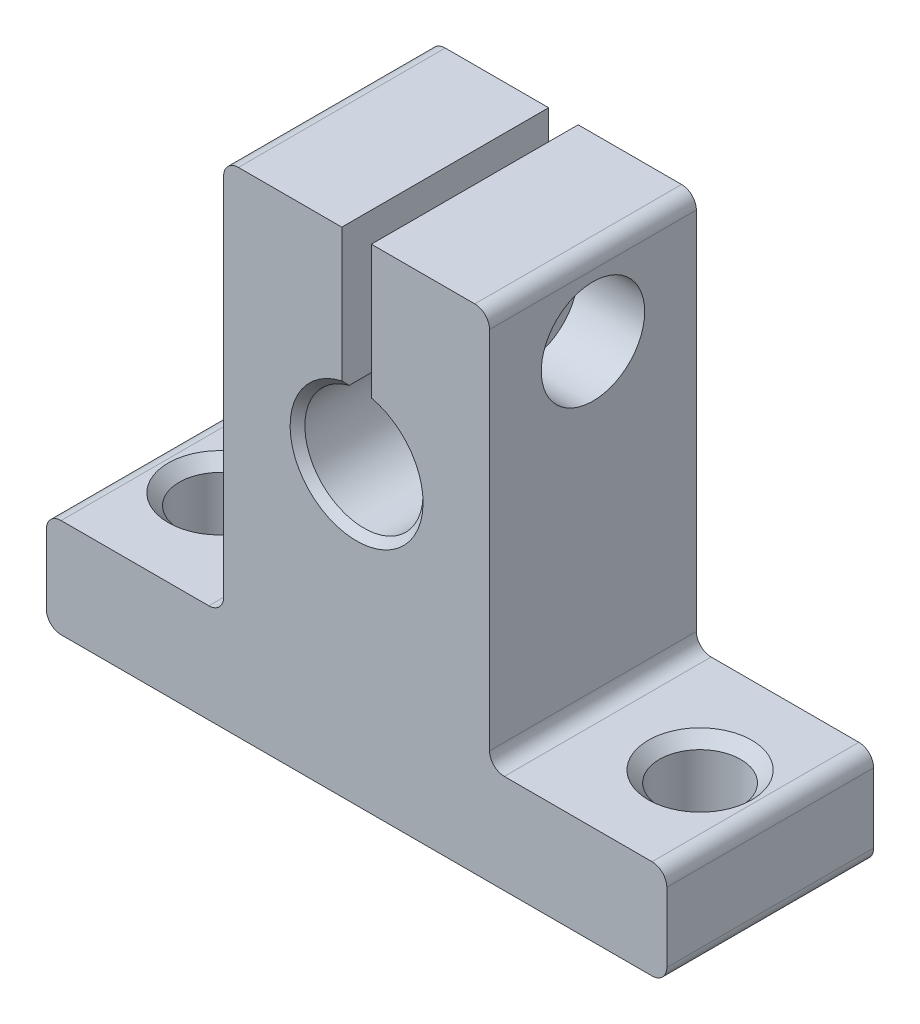
ISO-10303-21;
HEADER;
FILE_DESCRIPTION(('STEP AP214'),'2;1');
FILE_NAME('part.step','',(''),(''),'','','');
FILE_SCHEMA(('AUTOMOTIVE_DESIGN { 1 0 10303 214 1 1 1 1 }'));
ENDSEC;
DATA;
#1=APPLICATION_CONTEXT('core data for automotive mechanical design processes');
#2=APPLICATION_PROTOCOL_DEFINITION('international standard','automotive_design',2000,#1);
#3=PRODUCT_CONTEXT('',#1,'mechanical');
#4=PRODUCT('Part','Part','',(#3));
#5=PRODUCT_RELATED_PRODUCT_CATEGORY('part','',(#4));
#6=PRODUCT_DEFINITION_FORMATION('','',#4);
#7=PRODUCT_DEFINITION_CONTEXT('part definition',#1,'design');
#8=PRODUCT_DEFINITION('design','',#6,#7);
#9=PRODUCT_DEFINITION_SHAPE('','',#8);
#10=(LENGTH_UNIT() NAMED_UNIT(*) SI_UNIT(.MILLI.,.METRE.));
#11=(NAMED_UNIT(*) PLANE_ANGLE_UNIT() SI_UNIT($,.RADIAN.));
#12=(NAMED_UNIT(*) SI_UNIT($,.STERADIAN.) SOLID_ANGLE_UNIT());
#13=UNCERTAINTY_MEASURE_WITH_UNIT(LENGTH_MEASURE(1.E-05),#10,'distance_accuracy_value','');
#14=(GEOMETRIC_REPRESENTATION_CONTEXT(3) GLOBAL_UNCERTAINTY_ASSIGNED_CONTEXT((#13)) GLOBAL_UNIT_ASSIGNED_CONTEXT((#10,
#11,#12)) REPRESENTATION_CONTEXT('',''));
#15=CARTESIAN_POINT('',(0.,0.,0.));
#16=DIRECTION('',(0.,0.,1.));
#17=DIRECTION('',(1.,0.,0.));
#18=AXIS2_PLACEMENT_3D('',#15,#16,#17);
#19=CARTESIAN_POINT('',(-9.00000000000001,-13.3,14.));
#20=DIRECTION('',(0.,-1.,0.));
#21=DIRECTION('',(1.,0.,0.));
#22=AXIS2_PLACEMENT_3D('',#19,#20,#21);
#23=PLANE('',#22);
#24=DIRECTION('',(-1.,0.,0.));
#25=VECTOR('',#24,1.);
#26=CARTESIAN_POINT('',(-9.00000000000001,-13.3,14.));
#27=LINE('',#26,#25);
#28=CARTESIAN_POINT('',(-10.,-13.3,14.));
#29=VERTEX_POINT('',#28);
#30=CARTESIAN_POINT('',(-20.,-13.3,14.));
#31=VERTEX_POINT('',#30);
#32=EDGE_CURVE('E238',#29,#31,#27,.T.);
#33=ORIENTED_EDGE('',*,*,#32,.F.);
#34=DIRECTION('',(0.,0.,-1.));
#35=VECTOR('',#34,1.);
#36=CARTESIAN_POINT('',(-10.,-13.3,0.));
#37=LINE('',#36,#35);
#38=CARTESIAN_POINT('',(-10.,-13.3,0.));
#39=VERTEX_POINT('',#38);
#40=EDGE_CURVE('E319',#29,#39,#37,.T.);
#41=ORIENTED_EDGE('',*,*,#40,.T.);
#42=DIRECTION('',(-1.,0.,0.));
#43=VECTOR('',#42,1.);
#44=CARTESIAN_POINT('',(-9.00000000000001,-13.3,0.));
#45=LINE('',#44,#43);
#46=CARTESIAN_POINT('',(-20.,-13.3,0.));
#47=VERTEX_POINT('',#46);
#48=EDGE_CURVE('E269',#39,#47,#45,.T.);
#49=ORIENTED_EDGE('',*,*,#48,.T.);
#50=DIRECTION('',(0.,0.,-1.));
#51=VECTOR('',#50,1.);
#52=CARTESIAN_POINT('',(-20.,-13.3,14.));
#53=LINE('',#52,#51);
#54=EDGE_CURVE('E317',#47,#31,#53,.F.);
#55=ORIENTED_EDGE('',*,*,#54,.T.);
#56=EDGE_LOOP('',(#33,#41,#49,#55));
#57=FACE_BOUND('',#56,.T.);
#58=CARTESIAN_POINT('',(-16.25,-13.3,7.));
#59=DIRECTION('',(0.,1.,0.));
#60=DIRECTION('',(0.,0.,1.));
#61=AXIS2_PLACEMENT_3D('',#58,#59,#60);
#62=CIRCLE('',#61,3.5);
#63=CARTESIAN_POINT('',(-16.25,-13.3,10.5));
#64=VERTEX_POINT('',#63);
#65=EDGE_CURVE('E543',#64,#64,#62,.T.);
#66=ORIENTED_EDGE('',*,*,#65,.F.);
#67=EDGE_LOOP('',(#66));
#68=FACE_BOUND('',#67,.T.);
#69=ADVANCED_FACE('F52',(#57,#68),#23,.F.);
#70=CARTESIAN_POINT('',(8.99999999999999,-13.3,14.));
#71=DIRECTION('',(-1.,0.,0.));
#72=DIRECTION('',(0.,-1.,0.));
#73=AXIS2_PLACEMENT_3D('',#70,#71,#72);
#74=PLANE('',#73);
#75=DIRECTION('',(0.,1.,0.));
#76=VECTOR('',#75,1.);
#77=CARTESIAN_POINT('',(8.99999999999999,-13.3,14.));
#78=LINE('',#77,#76);
#79=CARTESIAN_POINT('',(8.99999999999999,-12.3,14.));
#80=VERTEX_POINT('',#79);
#81=CARTESIAN_POINT('',(8.99999999999999,12.4,14.));
#82=VERTEX_POINT('',#81);
#83=EDGE_CURVE('E216',#80,#82,#78,.T.);
#84=ORIENTED_EDGE('',*,*,#83,.F.);
#85=DIRECTION('',(0.,0.,-1.));
#86=VECTOR('',#85,1.);
#87=CARTESIAN_POINT('',(8.99999999999999,-12.3,0.));
#88=LINE('',#87,#86);
#89=CARTESIAN_POINT('',(8.99999999999999,-12.3,0.));
#90=VERTEX_POINT('',#89);
#91=EDGE_CURVE('E329',#80,#90,#88,.T.);
#92=ORIENTED_EDGE('',*,*,#91,.T.);
#93=DIRECTION('',(0.,1.,0.));
#94=VECTOR('',#93,1.);
#95=CARTESIAN_POINT('',(8.99999999999999,-13.3,0.));
#96=LINE('',#95,#94);
#97=CARTESIAN_POINT('',(8.99999999999999,12.4,0.));
#98=VERTEX_POINT('',#97);
#99=EDGE_CURVE('E255',#90,#98,#96,.T.);
#100=ORIENTED_EDGE('',*,*,#99,.T.);
#101=DIRECTION('',(0.,0.,-1.));
#102=VECTOR('',#101,1.);
#103=CARTESIAN_POINT('',(8.99999999999999,12.4,14.));
#104=LINE('',#103,#102);
#105=EDGE_CURVE('E327',#98,#82,#104,.F.);
#106=ORIENTED_EDGE('',*,*,#105,.T.);
#107=EDGE_LOOP('',(#84,#92,#100,#106));
#108=FACE_BOUND('',#107,.T.);
#109=CARTESIAN_POINT('',(8.99999999999999,8.2,7.));
#110=DIRECTION('',(1.,0.,0.));
#111=DIRECTION('',(0.,0.,-1.));
#112=AXIS2_PLACEMENT_3D('',#109,#110,#111);
#113=CIRCLE('',#112,3.5);
#114=CARTESIAN_POINT('',(8.99999999999999,8.2,3.5));
#115=VERTEX_POINT('',#114);
#116=EDGE_CURVE('E464',#115,#115,#113,.T.);
#117=ORIENTED_EDGE('',*,*,#116,.F.);
#118=EDGE_LOOP('',(#117));
#119=FACE_BOUND('',#118,.T.);
#120=ADVANCED_FACE('F440',(#108,#119),#74,.F.);
#121=CARTESIAN_POINT('',(-21.,-13.3,14.));
#122=DIRECTION('',(1.,0.,0.));
#123=DIRECTION('',(0.,1.,0.));
#124=AXIS2_PLACEMENT_3D('',#121,#122,#123);
#125=PLANE('',#124);
#126=DIRECTION('',(0.,-1.,0.));
#127=VECTOR('',#126,1.);
#128=CARTESIAN_POINT('',(-21.,-13.3,0.));
#129=LINE('',#128,#127);
#130=CARTESIAN_POINT('',(-21.,-14.3,0.));
#131=VERTEX_POINT('',#130);
#132=CARTESIAN_POINT('',(-21.,-19.,0.));
#133=VERTEX_POINT('',#132);
#134=EDGE_CURVE('E242',#131,#133,#129,.T.);
#135=ORIENTED_EDGE('',*,*,#134,.T.);
#136=DIRECTION('',(0.,0.,-1.));
#137=VECTOR('',#136,1.);
#138=CARTESIAN_POINT('',(-21.,-19.,14.));
#139=LINE('',#138,#137);
#140=CARTESIAN_POINT('',(-21.,-19.,14.));
#141=VERTEX_POINT('',#140);
#142=EDGE_CURVE('E315',#133,#141,#139,.F.);
#143=ORIENTED_EDGE('',*,*,#142,.T.);
#144=DIRECTION('',(0.,-1.,0.));
#145=VECTOR('',#144,1.);
#146=CARTESIAN_POINT('',(-21.,-13.3,14.));
#147=LINE('',#146,#145);
#148=CARTESIAN_POINT('',(-21.,-14.3,14.));
#149=VERTEX_POINT('',#148);
#150=EDGE_CURVE('E272',#149,#141,#147,.T.);
#151=ORIENTED_EDGE('',*,*,#150,.F.);
#152=DIRECTION('',(0.,0.,-1.));
#153=VECTOR('',#152,1.);
#154=CARTESIAN_POINT('',(-21.,-14.3,14.));
#155=LINE('',#154,#153);
#156=EDGE_CURVE('E312',#149,#131,#155,.T.);
#157=ORIENTED_EDGE('',*,*,#156,.T.);
#158=EDGE_LOOP('',(#135,#143,#151,#157));
#159=FACE_BOUND('',#158,.T.);
#160=ADVANCED_FACE('F436',(#159),#125,.F.);
#161=CARTESIAN_POINT('',(-21.,-20.,14.));
#162=DIRECTION('',(0.,1.,0.));
#163=DIRECTION('',(-1.,0.,0.));
#164=AXIS2_PLACEMENT_3D('',#161,#162,#163);
#165=PLANE('',#164);
#166=CARTESIAN_POINT('',(-16.25,-20.,7.));
#167=DIRECTION('',(0.,1.,0.));
#168=DIRECTION('',(0.,0.,1.));
#169=AXIS2_PLACEMENT_3D('',#166,#167,#168);
#170=CIRCLE('',#169,3.5);
#171=CARTESIAN_POINT('',(-16.25,-20.,10.5));
#172=VERTEX_POINT('',#171);
#173=EDGE_CURVE('E546',#172,#172,#170,.T.);
#174=ORIENTED_EDGE('',*,*,#173,.T.);
#175=EDGE_LOOP('',(#174));
#176=FACE_BOUND('',#175,.T.);
#177=CARTESIAN_POINT('',(16.25,-20.,7.));
#178=DIRECTION('',(0.,1.,0.));
#179=DIRECTION('',(0.,0.,1.));
#180=AXIS2_PLACEMENT_3D('',#177,#178,#179);
#181=CIRCLE('',#180,3.5);
#182=CARTESIAN_POINT('',(16.25,-20.,10.5));
#183=VERTEX_POINT('',#182);
#184=EDGE_CURVE('E556',#183,#183,#181,.T.);
#185=ORIENTED_EDGE('',*,*,#184,.T.);
#186=EDGE_LOOP('',(#185));
#187=FACE_BOUND('',#186,.T.);
#188=DIRECTION('',(1.,0.,0.));
#189=VECTOR('',#188,1.);
#190=CARTESIAN_POINT('',(-21.,-20.,0.));
#191=LINE('',#190,#189);
#192=CARTESIAN_POINT('',(-20.,-20.,0.));
#193=VERTEX_POINT('',#192);
#194=CARTESIAN_POINT('',(20.,-20.,0.));
#195=VERTEX_POINT('',#194);
#196=EDGE_CURVE('E245',#193,#195,#191,.T.);
#197=ORIENTED_EDGE('',*,*,#196,.T.);
#198=DIRECTION('',(0.,0.,-1.));
#199=VECTOR('',#198,1.);
#200=CARTESIAN_POINT('',(20.,-20.,14.));
#201=LINE('',#200,#199);
#202=CARTESIAN_POINT('',(20.,-20.,14.));
#203=VERTEX_POINT('',#202);
#204=EDGE_CURVE('E299',#195,#203,#201,.F.);
#205=ORIENTED_EDGE('',*,*,#204,.T.);
#206=DIRECTION('',(1.,0.,0.));
#207=VECTOR('',#206,1.);
#208=CARTESIAN_POINT('',(-21.,-20.,14.));
#209=LINE('',#208,#207);
#210=CARTESIAN_POINT('',(-20.,-20.,14.));
#211=VERTEX_POINT('',#210);
#212=EDGE_CURVE('E483',#211,#203,#209,.T.);
#213=ORIENTED_EDGE('',*,*,#212,.F.);
#214=DIRECTION('',(0.,0.,-1.));
#215=VECTOR('',#214,1.);
#216=CARTESIAN_POINT('',(-20.,-20.,14.));
#217=LINE('',#216,#215);
#218=EDGE_CURVE('E296',#211,#193,#217,.T.);
#219=ORIENTED_EDGE('',*,*,#218,.T.);
#220=EDGE_LOOP('',(#197,#205,#213,#219));
#221=FACE_BOUND('',#220,.T.);
#222=ADVANCED_FACE('F439',(#176,#187,#221),#165,.F.);
#223=CARTESIAN_POINT('',(21.,-20.,14.));
#224=DIRECTION('',(-1.,0.,0.));
#225=DIRECTION('',(0.,-1.,0.));
#226=AXIS2_PLACEMENT_3D('',#223,#224,#225);
#227=PLANE('',#226);
#228=DIRECTION('',(0.,1.,0.));
#229=VECTOR('',#228,1.);
#230=CARTESIAN_POINT('',(21.,-20.,14.));
#231=LINE('',#230,#229);
#232=CARTESIAN_POINT('',(21.,-19.,14.));
#233=VERTEX_POINT('',#232);
#234=CARTESIAN_POINT('',(21.,-14.3,14.));
#235=VERTEX_POINT('',#234);
#236=EDGE_CURVE('E486',#233,#235,#231,.T.);
#237=ORIENTED_EDGE('',*,*,#236,.F.);
#238=DIRECTION('',(0.,0.,-1.));
#239=VECTOR('',#238,1.);
#240=CARTESIAN_POINT('',(21.,-19.,14.));
#241=LINE('',#240,#239);
#242=CARTESIAN_POINT('',(21.,-19.,0.));
#243=VERTEX_POINT('',#242);
#244=EDGE_CURVE('E281',#233,#243,#241,.T.);
#245=ORIENTED_EDGE('',*,*,#244,.T.);
#246=DIRECTION('',(0.,1.,0.));
#247=VECTOR('',#246,1.);
#248=CARTESIAN_POINT('',(21.,-20.,0.));
#249=LINE('',#248,#247);
#250=CARTESIAN_POINT('',(21.,-14.3,0.));
#251=VERTEX_POINT('',#250);
#252=EDGE_CURVE('E249',#243,#251,#249,.T.);
#253=ORIENTED_EDGE('',*,*,#252,.T.);
#254=DIRECTION('',(0.,0.,-1.));
#255=VECTOR('',#254,1.);
#256=CARTESIAN_POINT('',(21.,-14.3,14.));
#257=LINE('',#256,#255);
#258=EDGE_CURVE('E223',#251,#235,#257,.F.);
#259=ORIENTED_EDGE('',*,*,#258,.T.);
#260=EDGE_LOOP('',(#237,#245,#253,#259));
#261=FACE_BOUND('',#260,.T.);
#262=ADVANCED_FACE('F444',(#261),#227,.F.);
#263=CARTESIAN_POINT('',(21.,-13.3,14.));
#264=DIRECTION('',(0.,-1.,0.));
#265=DIRECTION('',(1.,0.,0.));
#266=AXIS2_PLACEMENT_3D('',#263,#264,#265);
#267=PLANE('',#266);
#268=CARTESIAN_POINT('',(16.25,-13.3,7.));
#269=DIRECTION('',(0.,1.,0.));
#270=DIRECTION('',(0.,0.,1.));
#271=AXIS2_PLACEMENT_3D('',#268,#269,#270);
#272=CIRCLE('',#271,3.5);
#273=CARTESIAN_POINT('',(16.25,-13.3,10.5));
#274=VERTEX_POINT('',#273);
#275=EDGE_CURVE('E559',#274,#274,#272,.T.);
#276=ORIENTED_EDGE('',*,*,#275,.F.);
#277=EDGE_LOOP('',(#276));
#278=FACE_BOUND('',#277,.T.);
#279=DIRECTION('',(-1.,0.,0.));
#280=VECTOR('',#279,1.);
#281=CARTESIAN_POINT('',(21.,-13.3,0.));
#282=LINE('',#281,#280);
#283=CARTESIAN_POINT('',(20.,-13.3,0.));
#284=VERTEX_POINT('',#283);
#285=CARTESIAN_POINT('',(9.99999999999999,-13.3,0.));
#286=VERTEX_POINT('',#285);
#287=EDGE_CURVE('E252',#284,#286,#282,.T.);
#288=ORIENTED_EDGE('',*,*,#287,.T.);
#289=DIRECTION('',(0.,0.,-1.));
#290=VECTOR('',#289,1.);
#291=CARTESIAN_POINT('',(9.99999999999999,-13.3,14.));
#292=LINE('',#291,#290);
#293=CARTESIAN_POINT('',(9.99999999999999,-13.3,14.));
#294=VERTEX_POINT('',#293);
#295=EDGE_CURVE('E335',#286,#294,#292,.F.);
#296=ORIENTED_EDGE('',*,*,#295,.T.);
#297=DIRECTION('',(-1.,0.,0.));
#298=VECTOR('',#297,1.);
#299=CARTESIAN_POINT('',(21.,-13.3,14.));
#300=LINE('',#299,#298);
#301=CARTESIAN_POINT('',(20.,-13.3,14.));
#302=VERTEX_POINT('',#301);
#303=EDGE_CURVE('E489',#302,#294,#300,.T.);
#304=ORIENTED_EDGE('',*,*,#303,.F.);
#305=DIRECTION('',(0.,0.,-1.));
#306=VECTOR('',#305,1.);
#307=CARTESIAN_POINT('',(20.,-13.3,14.));
#308=LINE('',#307,#306);
#309=EDGE_CURVE('E332',#302,#284,#308,.T.);
#310=ORIENTED_EDGE('',*,*,#309,.T.);
#311=EDGE_LOOP('',(#288,#296,#304,#310));
#312=FACE_BOUND('',#311,.T.);
#313=ADVANCED_FACE('F448',(#278,#312),#267,.F.);
#314=CARTESIAN_POINT('',(8.99999999999999,13.4,14.));
#315=DIRECTION('',(0.,-1.,0.));
#316=DIRECTION('',(1.,0.,0.));
#317=AXIS2_PLACEMENT_3D('',#314,#315,#316);
#318=PLANE('',#317);
#319=DIRECTION('',(-1.,0.,0.));
#320=VECTOR('',#319,1.);
#321=CARTESIAN_POINT('',(8.99999999999999,13.4,14.));
#322=LINE('',#321,#320);
#323=CARTESIAN_POINT('',(7.99999999999999,13.4,14.));
#324=VERTEX_POINT('',#323);
#325=CARTESIAN_POINT('',(0.999999999999992,13.4,14.));
#326=VERTEX_POINT('',#325);
#327=EDGE_CURVE('E205',#324,#326,#322,.T.);
#328=ORIENTED_EDGE('',*,*,#327,.F.);
#329=DIRECTION('',(0.,0.,-1.));
#330=VECTOR('',#329,1.);
#331=CARTESIAN_POINT('',(7.99999999999999,13.4,14.));
#332=LINE('',#331,#330);
#333=CARTESIAN_POINT('',(7.99999999999999,13.4,0.));
#334=VERTEX_POINT('',#333);
#335=EDGE_CURVE('E337',#324,#334,#332,.T.);
#336=ORIENTED_EDGE('',*,*,#335,.T.);
#337=DIRECTION('',(-1.,0.,0.));
#338=VECTOR('',#337,1.);
#339=CARTESIAN_POINT('',(8.99999999999999,13.4,0.));
#340=LINE('',#339,#338);
#341=CARTESIAN_POINT('',(0.999999999999992,13.4,0.));
#342=VERTEX_POINT('',#341);
#343=EDGE_CURVE('E222',#334,#342,#340,.T.);
#344=ORIENTED_EDGE('',*,*,#343,.T.);
#345=DIRECTION('',(0.,0.,-1.));
#346=VECTOR('',#345,1.);
#347=CARTESIAN_POINT('',(0.999999999999992,13.4,14.));
#348=LINE('',#347,#346);
#349=EDGE_CURVE('E219',#326,#342,#348,.T.);
#350=ORIENTED_EDGE('',*,*,#349,.F.);
#351=EDGE_LOOP('',(#328,#336,#344,#350));
#352=FACE_BOUND('',#351,.T.);
#353=ADVANCED_FACE('F220',(#352),#318,.F.);
#354=CARTESIAN_POINT('',(0.999999999999992,13.4,14.));
#355=DIRECTION('',(1.,0.,0.));
#356=DIRECTION('',(0.,1.,0.));
#357=AXIS2_PLACEMENT_3D('',#354,#355,#356);
#358=PLANE('',#357);
#359=CARTESIAN_POINT('',(1.,8.2,7.));
#360=DIRECTION('',(1.,0.,0.));
#361=DIRECTION('',(0.,1.,0.));
#362=AXIS2_PLACEMENT_3D('',#359,#360,#361);
#363=CIRCLE('',#362,2.);
#364=CARTESIAN_POINT('',(0.999999999999999,10.2,7.));
#365=VERTEX_POINT('',#364);
#366=EDGE_CURVE('E246',#365,#365,#363,.T.);
#367=ORIENTED_EDGE('',*,*,#366,.T.);
#368=EDGE_LOOP('',(#367));
#369=FACE_BOUND('',#368,.T.);
#370=DIRECTION('',(0.,-1.,0.));
#371=VECTOR('',#370,1.);
#372=CARTESIAN_POINT('',(0.999999999999992,13.4,0.));
#373=LINE('',#372,#371);
#374=CARTESIAN_POINT('',(1.00000000000001,4.38748219369604,0.));
#375=VERTEX_POINT('',#374);
#376=EDGE_CURVE('E259',#342,#375,#373,.T.);
#377=ORIENTED_EDGE('',*,*,#376,.T.);
#378=CARTESIAN_POINT('',(1.00000000000001,4.38748219369604,0.));
#379=CARTESIAN_POINT('',(1.00000000000001,4.30187653737128,0.0834816574370422));
#380=CARTESIAN_POINT('',(1.00000000000001,4.21619880714145,0.166889150991902));
#381=CARTESIAN_POINT('',(1.00000000000001,4.04469919132459,0.33355581767162));
#382=CARTESIAN_POINT('',(1.00000000000001,3.95887730572488,0.416814990783423));
#383=CARTESIAN_POINT('',(1.00000000000001,3.87298334620741,0.49999999999999));
#384=B_SPLINE_CURVE_WITH_KNOTS('',3,(#378,#379,#380,#381,#382,#383),.UNSPECIFIED.,.F.,.F.,(4,2,
4),(0.,0.358716254086654,0.717432539744773),.UNSPECIFIED.);
#385=CARTESIAN_POINT('',(1.00000000000001,3.87298334620742,0.49999999999999));
#386=VERTEX_POINT('',#385);
#387=EDGE_CURVE('E61',#375,#386,#384,.T.);
#388=ORIENTED_EDGE('',*,*,#387,.T.);
#389=DIRECTION('',(0.,0.,-1.));
#390=VECTOR('',#389,1.);
#391=CARTESIAN_POINT('',(1.00000000000001,3.87298334620742,14.));
#392=LINE('',#391,#390);
#393=CARTESIAN_POINT('',(1.00000000000001,3.87298334620742,13.5));
#394=VERTEX_POINT('',#393);
#395=EDGE_CURVE('E224',#394,#386,#392,.T.);
#396=ORIENTED_EDGE('',*,*,#395,.F.);
#397=CARTESIAN_POINT('',(1.00000000000001,3.87298334620741,13.5));
#398=CARTESIAN_POINT('',(1.00000000000001,3.95887730572489,13.5831850092166));
#399=CARTESIAN_POINT('',(1.00000000000001,4.0446991913246,13.6664441823284));
#400=CARTESIAN_POINT('',(1.00000000000001,4.21619880714146,13.8331108490081));
#401=CARTESIAN_POINT('',(1.00000000000001,4.30187653737129,13.916518342563));
#402=CARTESIAN_POINT('',(1.00000000000001,4.38748219369606,14.));
#403=B_SPLINE_CURVE_WITH_KNOTS('',3,(#397,#398,#399,#400,#401,#402),.UNSPECIFIED.,.F.,.F.,(4,2,
4),(0.,0.358716285658128,0.717432539744792),.UNSPECIFIED.);
#404=CARTESIAN_POINT('',(1.00000000000001,4.38748219369606,14.));
#405=VERTEX_POINT('',#404);
#406=EDGE_CURVE('E68',#394,#405,#403,.T.);
#407=ORIENTED_EDGE('',*,*,#406,.T.);
#408=DIRECTION('',(0.,-1.,0.));
#409=VECTOR('',#408,1.);
#410=CARTESIAN_POINT('',(0.999999999999992,13.4,14.));
#411=LINE('',#410,#409);
#412=EDGE_CURVE('E208',#326,#405,#411,.T.);
#413=ORIENTED_EDGE('',*,*,#412,.F.);
#414=ORIENTED_EDGE('',*,*,#349,.T.);
#415=EDGE_LOOP('',(#377,#388,#396,#407,#413,#414));
#416=FACE_BOUND('',#415,.T.);
#417=ADVANCED_FACE('F226',(#369,#416),#358,.F.);
#418=CARTESIAN_POINT('',(0.,0.,14.));
#419=DIRECTION('',(0.,0.,-1.));
#420=DIRECTION('',(-1.,0.,0.));
#421=AXIS2_PLACEMENT_3D('',#418,#419,#420);
#422=CYLINDRICAL_SURFACE('',#421,4.);
#423=ORIENTED_EDGE('',*,*,#395,.T.);
#424=CARTESIAN_POINT('',(0.,0.,0.49999999999999));
#425=DIRECTION('',(0.,0.,1.));
#426=DIRECTION('',(1.,0.,0.));
#427=AXIS2_PLACEMENT_3D('',#424,#425,#426);
#428=CIRCLE('',#427,4.);
#429=CARTESIAN_POINT('',(-1.00000000000001,3.87298334620741,0.49999999999999));
#430=VERTEX_POINT('',#429);
#431=EDGE_CURVE('E351',#386,#430,#428,.F.);
#432=ORIENTED_EDGE('',*,*,#431,.T.);
#433=DIRECTION('',(0.,0.,-1.));
#434=VECTOR('',#433,1.);
#435=CARTESIAN_POINT('',(-1.00000000000001,3.87298334620741,14.));
#436=LINE('',#435,#434);
#437=CARTESIAN_POINT('',(-1.00000000000001,3.87298334620741,13.5));
#438=VERTEX_POINT('',#437);
#439=EDGE_CURVE('E275',#438,#430,#436,.T.);
#440=ORIENTED_EDGE('',*,*,#439,.F.);
#441=CARTESIAN_POINT('',(0.,0.,13.5));
#442=DIRECTION('',(0.,0.,1.));
#443=DIRECTION('',(1.,0.,0.));
#444=AXIS2_PLACEMENT_3D('',#441,#442,#443);
#445=CIRCLE('',#444,4.);
#446=EDGE_CURVE('E349',#438,#394,#445,.T.);
#447=ORIENTED_EDGE('',*,*,#446,.T.);
#448=EDGE_LOOP('',(#423,#432,#440,#447));
#449=FACE_BOUND('',#448,.T.);
#450=ADVANCED_FACE('F373',(#449),#422,.F.);
#451=CARTESIAN_POINT('',(-1.00000000000001,3.87298334620742,14.));
#452=DIRECTION('',(-1.,0.,0.));
#453=DIRECTION('',(0.,-1.,0.));
#454=AXIS2_PLACEMENT_3D('',#451,#452,#453);
#455=PLANE('',#454);
#456=CARTESIAN_POINT('',(-1.00000000000001,8.2,7.));
#457=DIRECTION('',(-1.,0.,0.));
#458=DIRECTION('',(0.,-1.,0.));
#459=AXIS2_PLACEMENT_3D('',#456,#457,#458);
#460=CIRCLE('',#459,1.75);
#461=CARTESIAN_POINT('',(-1.00000000000001,6.45,7.));
#462=VERTEX_POINT('',#461);
#463=EDGE_CURVE('E467',#462,#462,#460,.T.);
#464=ORIENTED_EDGE('',*,*,#463,.T.);
#465=EDGE_LOOP('',(#464));
#466=FACE_BOUND('',#465,.T.);
#467=ORIENTED_EDGE('',*,*,#439,.T.);
#468=CARTESIAN_POINT('',(-1.00000000000001,3.87298334620741,0.49999999999999));
#469=CARTESIAN_POINT('',(-1.00000000000001,3.95887730572488,0.416814990783423));
#470=CARTESIAN_POINT('',(-1.00000000000001,4.04469919132459,0.33355581767162));
#471=CARTESIAN_POINT('',(-1.00000000000001,4.21619880714145,0.166889150991902));
#472=CARTESIAN_POINT('',(-1.00000000000001,4.30187653737128,0.0834816574370421));
#473=CARTESIAN_POINT('',(-1.00000000000001,4.38748219369604,0.));
#474=B_SPLINE_CURVE_WITH_KNOTS('',3,(#468,#469,#470,#471,#472,#473),.UNSPECIFIED.,.F.,.F.,(4,2,
4),(0.,0.358716285658118,0.717432539744774),.UNSPECIFIED.);
#475=CARTESIAN_POINT('',(-1.00000000000001,4.38748219369604,0.));
#476=VERTEX_POINT('',#475);
#477=EDGE_CURVE('E361',#430,#476,#474,.T.);
#478=ORIENTED_EDGE('',*,*,#477,.T.);
#479=DIRECTION('',(0.,1.,0.));
#480=VECTOR('',#479,1.);
#481=CARTESIAN_POINT('',(-1.00000000000001,3.87298334620742,0.));
#482=LINE('',#481,#480);
#483=CARTESIAN_POINT('',(-1.00000000000001,13.4,0.));
#484=VERTEX_POINT('',#483);
#485=EDGE_CURVE('E261',#476,#484,#482,.T.);
#486=ORIENTED_EDGE('',*,*,#485,.T.);
#487=DIRECTION('',(0.,0.,-1.));
#488=VECTOR('',#487,1.);
#489=CARTESIAN_POINT('',(-1.00000000000001,13.4,14.));
#490=LINE('',#489,#488);
#491=CARTESIAN_POINT('',(-1.00000000000001,13.4,14.));
#492=VERTEX_POINT('',#491);
#493=EDGE_CURVE('E241',#492,#484,#490,.T.);
#494=ORIENTED_EDGE('',*,*,#493,.F.);
#495=DIRECTION('',(0.,1.,0.));
#496=VECTOR('',#495,1.);
#497=CARTESIAN_POINT('',(-1.00000000000001,3.87298334620742,14.));
#498=LINE('',#497,#496);
#499=CARTESIAN_POINT('',(-1.00000000000001,4.38748219369606,14.));
#500=VERTEX_POINT('',#499);
#501=EDGE_CURVE('E227',#500,#492,#498,.T.);
#502=ORIENTED_EDGE('',*,*,#501,.F.);
#503=CARTESIAN_POINT('',(-1.00000000000001,4.38748219369606,14.));
#504=CARTESIAN_POINT('',(-1.00000000000001,4.30187653737129,13.916518342563));
#505=CARTESIAN_POINT('',(-1.00000000000001,4.21619880714146,13.8331108490081));
#506=CARTESIAN_POINT('',(-1.00000000000001,4.0446991913246,13.6664441823284));
#507=CARTESIAN_POINT('',(-1.00000000000001,3.95887730572489,13.5831850092166));
#508=CARTESIAN_POINT('',(-1.00000000000001,3.87298334620741,13.5));
#509=B_SPLINE_CURVE_WITH_KNOTS('',3,(#503,#504,#505,#506,#507,#508),.UNSPECIFIED.,.F.,.F.,(4,2,
4),(0.,0.358716254086664,0.717432539744792),.UNSPECIFIED.);
#510=EDGE_CURVE('E354',#500,#438,#509,.T.);
#511=ORIENTED_EDGE('',*,*,#510,.T.);
#512=EDGE_LOOP('',(#467,#478,#486,#494,#502,#511));
#513=FACE_BOUND('',#512,.T.);
#514=ADVANCED_FACE('F367',(#466,#513),#455,.F.);
#515=CARTESIAN_POINT('',(-1.00000000000001,13.4,14.));
#516=DIRECTION('',(0.,-1.,0.));
#517=DIRECTION('',(0.,0.,-1.));
#518=AXIS2_PLACEMENT_3D('',#515,#516,#517);
#519=PLANE('',#518);
#520=DIRECTION('',(-1.,0.,0.));
#521=VECTOR('',#520,1.);
#522=CARTESIAN_POINT('',(-1.00000000000001,13.4,0.));
#523=LINE('',#522,#521);
#524=CARTESIAN_POINT('',(-8.00000000000001,13.4,0.));
#525=VERTEX_POINT('',#524);
#526=EDGE_CURVE('E263',#484,#525,#523,.T.);
#527=ORIENTED_EDGE('',*,*,#526,.T.);
#528=DIRECTION('',(0.,0.,-1.));
#529=VECTOR('',#528,1.);
#530=CARTESIAN_POINT('',(-8.00000000000001,13.4,14.));
#531=LINE('',#530,#529);
#532=CARTESIAN_POINT('',(-8.00000000000001,13.4,14.));
#533=VERTEX_POINT('',#532);
#534=EDGE_CURVE('E339',#525,#533,#531,.F.);
#535=ORIENTED_EDGE('',*,*,#534,.T.);
#536=DIRECTION('',(-1.,0.,0.));
#537=VECTOR('',#536,1.);
#538=CARTESIAN_POINT('',(-1.00000000000001,13.4,14.));
#539=LINE('',#538,#537);
#540=EDGE_CURVE('E229',#492,#533,#539,.T.);
#541=ORIENTED_EDGE('',*,*,#540,.F.);
#542=ORIENTED_EDGE('',*,*,#493,.T.);
#543=EDGE_LOOP('',(#527,#535,#541,#542));
#544=FACE_BOUND('',#543,.T.);
#545=ADVANCED_FACE('F372',(#544),#519,.F.);
#546=CARTESIAN_POINT('',(-9.00000000000001,13.4,14.));
#547=DIRECTION('',(1.,0.,0.));
#548=DIRECTION('',(0.,1.,0.));
#549=AXIS2_PLACEMENT_3D('',#546,#547,#548);
#550=PLANE('',#549);
#551=CARTESIAN_POINT('',(-9.00000000000002,8.2,7.));
#552=DIRECTION('',(-1.,0.,0.));
#553=DIRECTION('',(0.,0.,1.));
#554=AXIS2_PLACEMENT_3D('',#551,#552,#553);
#555=CIRCLE('',#554,2.75);
#556=CARTESIAN_POINT('',(-9.00000000000002,8.2,9.75));
#557=VERTEX_POINT('',#556);
#558=EDGE_CURVE('E568',#557,#557,#555,.T.);
#559=ORIENTED_EDGE('',*,*,#558,.F.);
#560=EDGE_LOOP('',(#559));
#561=FACE_BOUND('',#560,.T.);
#562=DIRECTION('',(0.,-1.,0.));
#563=VECTOR('',#562,1.);
#564=CARTESIAN_POINT('',(-9.00000000000001,13.4,0.));
#565=LINE('',#564,#563);
#566=CARTESIAN_POINT('',(-9.00000000000001,12.4,0.));
#567=VERTEX_POINT('',#566);
#568=CARTESIAN_POINT('',(-9.00000000000001,-12.3,0.));
#569=VERTEX_POINT('',#568);
#570=EDGE_CURVE('E266',#567,#569,#565,.T.);
#571=ORIENTED_EDGE('',*,*,#570,.T.);
#572=DIRECTION('',(0.,0.,-1.));
#573=VECTOR('',#572,1.);
#574=CARTESIAN_POINT('',(-9.00000000000001,-12.3,14.));
#575=LINE('',#574,#573);
#576=CARTESIAN_POINT('',(-9.00000000000001,-12.3,14.));
#577=VERTEX_POINT('',#576);
#578=EDGE_CURVE('E325',#569,#577,#575,.F.);
#579=ORIENTED_EDGE('',*,*,#578,.T.);
#580=DIRECTION('',(0.,-1.,0.));
#581=VECTOR('',#580,1.);
#582=CARTESIAN_POINT('',(-9.00000000000001,13.4,14.));
#583=LINE('',#582,#581);
#584=CARTESIAN_POINT('',(-9.00000000000001,12.4,14.));
#585=VERTEX_POINT('',#584);
#586=EDGE_CURVE('E235',#585,#577,#583,.T.);
#587=ORIENTED_EDGE('',*,*,#586,.F.);
#588=DIRECTION('',(0.,0.,-1.));
#589=VECTOR('',#588,1.);
#590=CARTESIAN_POINT('',(-9.00000000000001,12.4,14.));
#591=LINE('',#590,#589);
#592=EDGE_CURVE('E322',#585,#567,#591,.T.);
#593=ORIENTED_EDGE('',*,*,#592,.T.);
#594=EDGE_LOOP('',(#571,#579,#587,#593));
#595=FACE_BOUND('',#594,.T.);
#596=ADVANCED_FACE('F511',(#561,#595),#550,.F.);
#597=CARTESIAN_POINT('',(0.,0.,14.));
#598=DIRECTION('',(0.,0.,1.));
#599=DIRECTION('',(1.,0.,0.));
#600=AXIS2_PLACEMENT_3D('',#597,#598,#599);
#601=PLANE('',#600);
#602=ORIENTED_EDGE('',*,*,#412,.T.);
#603=CARTESIAN_POINT('',(0.,0.,14.));
#604=DIRECTION('',(0.,0.,1.));
#605=DIRECTION('',(1.,0.,0.));
#606=AXIS2_PLACEMENT_3D('',#603,#604,#605);
#607=CIRCLE('',#606,4.5);
#608=EDGE_CURVE('E13',#405,#500,#607,.F.);
#609=ORIENTED_EDGE('',*,*,#608,.T.);
#610=ORIENTED_EDGE('',*,*,#501,.T.);
#611=ORIENTED_EDGE('',*,*,#540,.T.);
#612=CARTESIAN_POINT('',(-8.00000000000001,12.4,14.));
#613=DIRECTION('',(0.,0.,1.));
#614=DIRECTION('',(1.,0.,0.));
#615=AXIS2_PLACEMENT_3D('',#612,#613,#614);
#616=CIRCLE('',#615,1.);
#617=EDGE_CURVE('E305',#533,#585,#616,.T.);
#618=ORIENTED_EDGE('',*,*,#617,.T.);
#619=ORIENTED_EDGE('',*,*,#586,.T.);
#620=CARTESIAN_POINT('',(-10.,-12.3,14.));
#621=DIRECTION('',(0.,0.,1.));
#622=DIRECTION('',(1.,0.,0.));
#623=AXIS2_PLACEMENT_3D('',#620,#621,#622);
#624=CIRCLE('',#623,1.);
#625=EDGE_CURVE('E343',#577,#29,#624,.F.);
#626=ORIENTED_EDGE('',*,*,#625,.T.);
#627=ORIENTED_EDGE('',*,*,#32,.T.);
#628=CARTESIAN_POINT('',(-20.,-14.3,14.));
#629=DIRECTION('',(0.,0.,1.));
#630=DIRECTION('',(1.,0.,0.));
#631=AXIS2_PLACEMENT_3D('',#628,#629,#630);
#632=CIRCLE('',#631,1.);
#633=EDGE_CURVE('E303',#31,#149,#632,.T.);
#634=ORIENTED_EDGE('',*,*,#633,.T.);
#635=ORIENTED_EDGE('',*,*,#150,.T.);
#636=CARTESIAN_POINT('',(-20.,-19.,14.));
#637=DIRECTION('',(0.,0.,1.));
#638=DIRECTION('',(1.,0.,0.));
#639=AXIS2_PLACEMENT_3D('',#636,#637,#638);
#640=CIRCLE('',#639,1.);
#641=EDGE_CURVE('E308',#141,#211,#640,.T.);
#642=ORIENTED_EDGE('',*,*,#641,.T.);
#643=ORIENTED_EDGE('',*,*,#212,.T.);
#644=CARTESIAN_POINT('',(20.,-19.,14.));
#645=DIRECTION('',(0.,0.,1.));
#646=DIRECTION('',(1.,0.,0.));
#647=AXIS2_PLACEMENT_3D('',#644,#645,#646);
#648=CIRCLE('',#647,1.);
#649=EDGE_CURVE('E310',#203,#233,#648,.T.);
#650=ORIENTED_EDGE('',*,*,#649,.T.);
#651=ORIENTED_EDGE('',*,*,#236,.T.);
#652=CARTESIAN_POINT('',(20.,-14.3,14.));
#653=DIRECTION('',(0.,0.,1.));
#654=DIRECTION('',(1.,0.,0.));
#655=AXIS2_PLACEMENT_3D('',#652,#653,#654);
#656=CIRCLE('',#655,1.);
#657=EDGE_CURVE('E301',#235,#302,#656,.T.);
#658=ORIENTED_EDGE('',*,*,#657,.T.);
#659=ORIENTED_EDGE('',*,*,#303,.T.);
#660=CARTESIAN_POINT('',(9.99999999999999,-12.3,14.));
#661=DIRECTION('',(0.,0.,1.));
#662=DIRECTION('',(1.,0.,0.));
#663=AXIS2_PLACEMENT_3D('',#660,#661,#662);
#664=CIRCLE('',#663,1.);
#665=EDGE_CURVE('E347',#294,#80,#664,.F.);
#666=ORIENTED_EDGE('',*,*,#665,.T.);
#667=ORIENTED_EDGE('',*,*,#83,.T.);
#668=CARTESIAN_POINT('',(7.99999999999999,12.4,14.));
#669=DIRECTION('',(0.,0.,1.));
#670=DIRECTION('',(1.,0.,0.));
#671=AXIS2_PLACEMENT_3D('',#668,#669,#670);
#672=CIRCLE('',#671,1.);
#673=EDGE_CURVE('E212',#82,#324,#672,.T.);
#674=ORIENTED_EDGE('',*,*,#673,.T.);
#675=ORIENTED_EDGE('',*,*,#327,.T.);
#676=EDGE_LOOP('',(#602,#609,#610,#611,#618,#619,#626,#627,#634,#635,#642,#643,#650,#651,#658,
#659,#666,#667,#674,#675));
#677=FACE_BOUND('',#676,.T.);
#678=ADVANCED_FACE('F207',(#677),#601,.T.);
#679=CARTESIAN_POINT('',(0.,0.,0.));
#680=DIRECTION('',(0.,0.,1.));
#681=DIRECTION('',(1.,0.,0.));
#682=AXIS2_PLACEMENT_3D('',#679,#680,#681);
#683=PLANE('',#682);
#684=ORIENTED_EDGE('',*,*,#485,.F.);
#685=CARTESIAN_POINT('',(0.,0.,0.));
#686=DIRECTION('',(0.,0.,1.));
#687=DIRECTION('',(1.,0.,0.));
#688=AXIS2_PLACEMENT_3D('',#685,#686,#687);
#689=CIRCLE('',#688,4.49999999999998);
#690=EDGE_CURVE('E76',#476,#375,#689,.T.);
#691=ORIENTED_EDGE('',*,*,#690,.T.);
#692=ORIENTED_EDGE('',*,*,#376,.F.);
#693=ORIENTED_EDGE('',*,*,#343,.F.);
#694=CARTESIAN_POINT('',(7.99999999999999,12.4,0.));
#695=DIRECTION('',(0.,0.,1.));
#696=DIRECTION('',(1.,0.,0.));
#697=AXIS2_PLACEMENT_3D('',#694,#695,#696);
#698=CIRCLE('',#697,1.);
#699=EDGE_CURVE('E290',#334,#98,#698,.F.);
#700=ORIENTED_EDGE('',*,*,#699,.T.);
#701=ORIENTED_EDGE('',*,*,#99,.F.);
#702=CARTESIAN_POINT('',(9.99999999999999,-12.3,0.));
#703=DIRECTION('',(0.,0.,1.));
#704=DIRECTION('',(1.,0.,0.));
#705=AXIS2_PLACEMENT_3D('',#702,#703,#704);
#706=CIRCLE('',#705,1.);
#707=EDGE_CURVE('E345',#90,#286,#706,.T.);
#708=ORIENTED_EDGE('',*,*,#707,.T.);
#709=ORIENTED_EDGE('',*,*,#287,.F.);
#710=CARTESIAN_POINT('',(20.,-14.3,0.));
#711=DIRECTION('',(0.,0.,1.));
#712=DIRECTION('',(1.,0.,0.));
#713=AXIS2_PLACEMENT_3D('',#710,#711,#712);
#714=CIRCLE('',#713,1.);
#715=EDGE_CURVE('E284',#284,#251,#714,.F.);
#716=ORIENTED_EDGE('',*,*,#715,.T.);
#717=ORIENTED_EDGE('',*,*,#252,.F.);
#718=CARTESIAN_POINT('',(20.,-19.,0.));
#719=DIRECTION('',(0.,0.,1.));
#720=DIRECTION('',(1.,0.,0.));
#721=AXIS2_PLACEMENT_3D('',#718,#719,#720);
#722=CIRCLE('',#721,1.);
#723=EDGE_CURVE('E294',#243,#195,#722,.F.);
#724=ORIENTED_EDGE('',*,*,#723,.T.);
#725=ORIENTED_EDGE('',*,*,#196,.F.);
#726=CARTESIAN_POINT('',(-20.,-19.,0.));
#727=DIRECTION('',(0.,0.,1.));
#728=DIRECTION('',(1.,0.,0.));
#729=AXIS2_PLACEMENT_3D('',#726,#727,#728);
#730=CIRCLE('',#729,1.);
#731=EDGE_CURVE('E292',#193,#133,#730,.F.);
#732=ORIENTED_EDGE('',*,*,#731,.T.);
#733=ORIENTED_EDGE('',*,*,#134,.F.);
#734=CARTESIAN_POINT('',(-20.,-14.3,0.));
#735=DIRECTION('',(0.,0.,1.));
#736=DIRECTION('',(1.,0.,0.));
#737=AXIS2_PLACEMENT_3D('',#734,#735,#736);
#738=CIRCLE('',#737,1.);
#739=EDGE_CURVE('E286',#131,#47,#738,.F.);
#740=ORIENTED_EDGE('',*,*,#739,.T.);
#741=ORIENTED_EDGE('',*,*,#48,.F.);
#742=CARTESIAN_POINT('',(-10.,-12.3,0.));
#743=DIRECTION('',(0.,0.,1.));
#744=DIRECTION('',(1.,0.,0.));
#745=AXIS2_PLACEMENT_3D('',#742,#743,#744);
#746=CIRCLE('',#745,1.);
#747=EDGE_CURVE('E341',#39,#569,#746,.T.);
#748=ORIENTED_EDGE('',*,*,#747,.T.);
#749=ORIENTED_EDGE('',*,*,#570,.F.);
#750=CARTESIAN_POINT('',(-8.00000000000001,12.4,0.));
#751=DIRECTION('',(0.,0.,1.));
#752=DIRECTION('',(1.,0.,0.));
#753=AXIS2_PLACEMENT_3D('',#750,#751,#752);
#754=CIRCLE('',#753,1.);
#755=EDGE_CURVE('E288',#567,#525,#754,.F.);
#756=ORIENTED_EDGE('',*,*,#755,.T.);
#757=ORIENTED_EDGE('',*,*,#526,.F.);
#758=EDGE_LOOP('',(#684,#691,#692,#693,#700,#701,#708,#709,#716,#717,#724,#725,#732,#733,#740,
#741,#748,#749,#756,#757));
#759=FACE_BOUND('',#758,.T.);
#760=ADVANCED_FACE('F434',(#759),#683,.F.);
#761=CARTESIAN_POINT('',(20.,-19.,14.));
#762=DIRECTION('',(0.,0.,-1.));
#763=DIRECTION('',(-1.,0.,0.));
#764=AXIS2_PLACEMENT_3D('',#761,#762,#763);
#765=CYLINDRICAL_SURFACE('',#764,1.);
#766=ORIENTED_EDGE('',*,*,#649,.F.);
#767=ORIENTED_EDGE('',*,*,#204,.F.);
#768=ORIENTED_EDGE('',*,*,#723,.F.);
#769=ORIENTED_EDGE('',*,*,#244,.F.);
#770=EDGE_LOOP('',(#766,#767,#768,#769));
#771=FACE_BOUND('',#770,.T.);
#772=ADVANCED_FACE('F430',(#771),#765,.T.);
#773=CARTESIAN_POINT('',(-20.,-19.,14.));
#774=DIRECTION('',(0.,0.,-1.));
#775=DIRECTION('',(-1.,0.,0.));
#776=AXIS2_PLACEMENT_3D('',#773,#774,#775);
#777=CYLINDRICAL_SURFACE('',#776,1.);
#778=ORIENTED_EDGE('',*,*,#641,.F.);
#779=ORIENTED_EDGE('',*,*,#142,.F.);
#780=ORIENTED_EDGE('',*,*,#731,.F.);
#781=ORIENTED_EDGE('',*,*,#218,.F.);
#782=EDGE_LOOP('',(#778,#779,#780,#781));
#783=FACE_BOUND('',#782,.T.);
#784=ADVANCED_FACE('F426',(#783),#777,.T.);
#785=CARTESIAN_POINT('',(-10.,-12.3,14.));
#786=DIRECTION('',(0.,0.,1.));
#787=DIRECTION('',(1.,0.,0.));
#788=AXIS2_PLACEMENT_3D('',#785,#786,#787);
#789=CYLINDRICAL_SURFACE('',#788,1.);
#790=ORIENTED_EDGE('',*,*,#625,.F.);
#791=ORIENTED_EDGE('',*,*,#578,.F.);
#792=ORIENTED_EDGE('',*,*,#747,.F.);
#793=ORIENTED_EDGE('',*,*,#40,.F.);
#794=EDGE_LOOP('',(#790,#791,#792,#793));
#795=FACE_BOUND('',#794,.T.);
#796=ADVANCED_FACE('F422',(#795),#789,.F.);
#797=CARTESIAN_POINT('',(9.99999999999999,-12.3,14.));
#798=DIRECTION('',(0.,0.,1.));
#799=DIRECTION('',(1.,0.,0.));
#800=AXIS2_PLACEMENT_3D('',#797,#798,#799);
#801=CYLINDRICAL_SURFACE('',#800,1.);
#802=ORIENTED_EDGE('',*,*,#665,.F.);
#803=ORIENTED_EDGE('',*,*,#295,.F.);
#804=ORIENTED_EDGE('',*,*,#707,.F.);
#805=ORIENTED_EDGE('',*,*,#91,.F.);
#806=EDGE_LOOP('',(#802,#803,#804,#805));
#807=FACE_BOUND('',#806,.T.);
#808=ADVANCED_FACE('F418',(#807),#801,.F.);
#809=CARTESIAN_POINT('',(7.99999999999999,12.4,14.));
#810=DIRECTION('',(0.,0.,-1.));
#811=DIRECTION('',(-1.,0.,0.));
#812=AXIS2_PLACEMENT_3D('',#809,#810,#811);
#813=CYLINDRICAL_SURFACE('',#812,1.);
#814=ORIENTED_EDGE('',*,*,#673,.F.);
#815=ORIENTED_EDGE('',*,*,#105,.F.);
#816=ORIENTED_EDGE('',*,*,#699,.F.);
#817=ORIENTED_EDGE('',*,*,#335,.F.);
#818=EDGE_LOOP('',(#814,#815,#816,#817));
#819=FACE_BOUND('',#818,.T.);
#820=ADVANCED_FACE('F414',(#819),#813,.T.);
#821=CARTESIAN_POINT('',(-8.00000000000001,12.4,14.));
#822=DIRECTION('',(0.,0.,-1.));
#823=DIRECTION('',(-1.,0.,0.));
#824=AXIS2_PLACEMENT_3D('',#821,#822,#823);
#825=CYLINDRICAL_SURFACE('',#824,1.);
#826=ORIENTED_EDGE('',*,*,#617,.F.);
#827=ORIENTED_EDGE('',*,*,#534,.F.);
#828=ORIENTED_EDGE('',*,*,#755,.F.);
#829=ORIENTED_EDGE('',*,*,#592,.F.);
#830=EDGE_LOOP('',(#826,#827,#828,#829));
#831=FACE_BOUND('',#830,.T.);
#832=ADVANCED_FACE('F410',(#831),#825,.T.);
#833=CARTESIAN_POINT('',(-20.,-14.3,14.));
#834=DIRECTION('',(0.,0.,-1.));
#835=DIRECTION('',(-1.,0.,0.));
#836=AXIS2_PLACEMENT_3D('',#833,#834,#835);
#837=CYLINDRICAL_SURFACE('',#836,1.);
#838=ORIENTED_EDGE('',*,*,#633,.F.);
#839=ORIENTED_EDGE('',*,*,#54,.F.);
#840=ORIENTED_EDGE('',*,*,#739,.F.);
#841=ORIENTED_EDGE('',*,*,#156,.F.);
#842=EDGE_LOOP('',(#838,#839,#840,#841));
#843=FACE_BOUND('',#842,.T.);
#844=ADVANCED_FACE('F406',(#843),#837,.T.);
#845=CARTESIAN_POINT('',(20.,-14.3,14.));
#846=DIRECTION('',(0.,0.,-1.));
#847=DIRECTION('',(-1.,0.,0.));
#848=AXIS2_PLACEMENT_3D('',#845,#846,#847);
#849=CYLINDRICAL_SURFACE('',#848,1.);
#850=ORIENTED_EDGE('',*,*,#657,.F.);
#851=ORIENTED_EDGE('',*,*,#258,.F.);
#852=ORIENTED_EDGE('',*,*,#715,.F.);
#853=ORIENTED_EDGE('',*,*,#309,.F.);
#854=EDGE_LOOP('',(#850,#851,#852,#853));
#855=FACE_BOUND('',#854,.T.);
#856=ADVANCED_FACE('F401',(#855),#849,.T.);
#857=CARTESIAN_POINT('',(8.99999999999999,8.2,7.));
#858=DIRECTION('',(1.,0.,0.));
#859=DIRECTION('',(0.,0.,-1.));
#860=AXIS2_PLACEMENT_3D('',#857,#858,#859);
#861=CYLINDRICAL_SURFACE('',#860,2.);
#862=ORIENTED_EDGE('',*,*,#366,.F.);
#863=EDGE_LOOP('',(#862));
#864=FACE_BOUND('',#863,.T.);
#865=CARTESIAN_POINT('',(4.49999999999999,8.2,7.));
#866=DIRECTION('',(1.,0.,0.));
#867=DIRECTION('',(0.,0.,-1.));
#868=AXIS2_PLACEMENT_3D('',#865,#866,#867);
#869=CIRCLE('',#868,2.);
#870=CARTESIAN_POINT('',(4.49999999999999,8.2,5.));
#871=VERTEX_POINT('',#870);
#872=EDGE_CURVE('E470',#871,#871,#869,.T.);
#873=ORIENTED_EDGE('',*,*,#872,.T.);
#874=EDGE_LOOP('',(#873));
#875=FACE_BOUND('',#874,.T.);
#876=ADVANCED_FACE('F405',(#864,#875),#861,.F.);
#877=CARTESIAN_POINT('',(4.49999999999999,10.2,7.));
#878=DIRECTION('',(-1.,0.,0.));
#879=DIRECTION('',(0.,0.,1.));
#880=AXIS2_PLACEMENT_3D('',#877,#878,#879);
#881=PLANE('',#880);
#882=ORIENTED_EDGE('',*,*,#872,.F.);
#883=EDGE_LOOP('',(#882));
#884=FACE_BOUND('',#883,.T.);
#885=CARTESIAN_POINT('',(4.49999999999999,8.2,7.));
#886=DIRECTION('',(1.,0.,0.));
#887=DIRECTION('',(0.,0.,-1.));
#888=AXIS2_PLACEMENT_3D('',#885,#886,#887);
#889=CIRCLE('',#888,3.5);
#890=CARTESIAN_POINT('',(4.49999999999999,8.2,3.5));
#891=VERTEX_POINT('',#890);
#892=EDGE_CURVE('E466',#891,#891,#889,.T.);
#893=ORIENTED_EDGE('',*,*,#892,.T.);
#894=EDGE_LOOP('',(#893));
#895=FACE_BOUND('',#894,.T.);
#896=ADVANCED_FACE('F593',(#884,#895),#881,.F.);
#897=CARTESIAN_POINT('',(8.99999999999999,8.2,7.));
#898=DIRECTION('',(1.,0.,0.));
#899=DIRECTION('',(0.,0.,-1.));
#900=AXIS2_PLACEMENT_3D('',#897,#898,#899);
#901=CYLINDRICAL_SURFACE('',#900,3.5);
#902=ORIENTED_EDGE('',*,*,#892,.F.);
#903=EDGE_LOOP('',(#902));
#904=FACE_BOUND('',#903,.T.);
#905=ORIENTED_EDGE('',*,*,#116,.T.);
#906=EDGE_LOOP('',(#905));
#907=FACE_BOUND('',#906,.T.);
#908=ADVANCED_FACE('F597',(#904,#907),#901,.F.);
#909=CARTESIAN_POINT('',(-9.00000000000001,8.2,7.));
#910=DIRECTION('',(-1.,0.,0.));
#911=DIRECTION('',(0.,0.,1.));
#912=AXIS2_PLACEMENT_3D('',#909,#910,#911);
#913=CYLINDRICAL_SURFACE('',#912,1.75);
#914=ORIENTED_EDGE('',*,*,#463,.F.);
#915=EDGE_LOOP('',(#914));
#916=FACE_BOUND('',#915,.T.);
#917=CARTESIAN_POINT('',(-8.00000000000001,8.2,7.));
#918=DIRECTION('',(-1.,0.,0.));
#919=DIRECTION('',(0.,0.,1.));
#920=AXIS2_PLACEMENT_3D('',#917,#918,#919);
#921=CIRCLE('',#920,1.75);
#922=CARTESIAN_POINT('',(-8.00000000000001,8.2,8.75));
#923=VERTEX_POINT('',#922);
#924=EDGE_CURVE('E473',#923,#923,#921,.T.);
#925=ORIENTED_EDGE('',*,*,#924,.T.);
#926=EDGE_LOOP('',(#925));
#927=FACE_BOUND('',#926,.T.);
#928=ADVANCED_FACE('F573',(#916,#927),#913,.F.);
#929=CARTESIAN_POINT('',(-9.00000000000002,8.2,7.));
#930=DIRECTION('',(-1.,0.,0.));
#931=DIRECTION('',(0.,0.,1.));
#932=AXIS2_PLACEMENT_3D('',#929,#930,#931);
#933=CONICAL_SURFACE('',#932,2.75,0.785398163397447);
#934=ORIENTED_EDGE('',*,*,#924,.F.);
#935=EDGE_LOOP('',(#934));
#936=FACE_BOUND('',#935,.T.);
#937=ORIENTED_EDGE('',*,*,#558,.T.);
#938=EDGE_LOOP('',(#937));
#939=FACE_BOUND('',#938,.T.);
#940=ADVANCED_FACE('F575',(#936,#939),#933,.F.);
#941=CARTESIAN_POINT('',(16.25,-19.25,7.));
#942=DIRECTION('',(0.,-1.,0.));
#943=DIRECTION('',(0.,0.,-1.));
#944=AXIS2_PLACEMENT_3D('',#941,#942,#943);
#945=CONICAL_SURFACE('',#944,2.75,0.785398163397448);
#946=ORIENTED_EDGE('',*,*,#184,.F.);
#947=EDGE_LOOP('',(#946));
#948=FACE_BOUND('',#947,.T.);
#949=CARTESIAN_POINT('',(16.25,-19.25,7.));
#950=DIRECTION('',(0.,1.,0.));
#951=DIRECTION('',(0.,0.,1.));
#952=AXIS2_PLACEMENT_3D('',#949,#950,#951);
#953=CIRCLE('',#952,2.75);
#954=CARTESIAN_POINT('',(16.25,-19.25,9.75));
#955=VERTEX_POINT('',#954);
#956=EDGE_CURVE('E565',#955,#955,#953,.T.);
#957=ORIENTED_EDGE('',*,*,#956,.T.);
#958=EDGE_LOOP('',(#957));
#959=FACE_BOUND('',#958,.T.);
#960=ADVANCED_FACE('F578',(#948,#959),#945,.F.);
#961=CARTESIAN_POINT('',(16.25,-13.3,7.));
#962=DIRECTION('',(0.,1.,0.));
#963=DIRECTION('',(0.,0.,1.));
#964=AXIS2_PLACEMENT_3D('',#961,#962,#963);
#965=CYLINDRICAL_SURFACE('',#964,2.75);
#966=ORIENTED_EDGE('',*,*,#956,.F.);
#967=EDGE_LOOP('',(#966));
#968=FACE_BOUND('',#967,.T.);
#969=CARTESIAN_POINT('',(16.25,-14.05,7.));
#970=DIRECTION('',(0.,1.,0.));
#971=DIRECTION('',(0.,0.,1.));
#972=AXIS2_PLACEMENT_3D('',#969,#970,#971);
#973=CIRCLE('',#972,2.75);
#974=CARTESIAN_POINT('',(16.25,-14.05,9.75));
#975=VERTEX_POINT('',#974);
#976=EDGE_CURVE('E562',#975,#975,#973,.T.);
#977=ORIENTED_EDGE('',*,*,#976,.T.);
#978=EDGE_LOOP('',(#977));
#979=FACE_BOUND('',#978,.T.);
#980=ADVANCED_FACE('F607',(#968,#979),#965,.F.);
#981=CARTESIAN_POINT('',(16.25,-13.3,7.));
#982=DIRECTION('',(0.,1.,0.));
#983=DIRECTION('',(0.,0.,1.));
#984=AXIS2_PLACEMENT_3D('',#981,#982,#983);
#985=CONICAL_SURFACE('',#984,3.5,0.785398163397447);
#986=ORIENTED_EDGE('',*,*,#976,.F.);
#987=EDGE_LOOP('',(#986));
#988=FACE_BOUND('',#987,.T.);
#989=ORIENTED_EDGE('',*,*,#275,.T.);
#990=EDGE_LOOP('',(#989));
#991=FACE_BOUND('',#990,.T.);
#992=ADVANCED_FACE('F611',(#988,#991),#985,.F.);
#993=CARTESIAN_POINT('',(-16.25,-19.25,7.));
#994=DIRECTION('',(0.,-1.,0.));
#995=DIRECTION('',(0.,0.,-1.));
#996=AXIS2_PLACEMENT_3D('',#993,#994,#995);
#997=CONICAL_SURFACE('',#996,2.75,0.785398163397448);
#998=ORIENTED_EDGE('',*,*,#173,.F.);
#999=EDGE_LOOP('',(#998));
#1000=FACE_BOUND('',#999,.T.);
#1001=CARTESIAN_POINT('',(-16.25,-19.25,7.));
#1002=DIRECTION('',(0.,1.,0.));
#1003=DIRECTION('',(0.,0.,1.));
#1004=AXIS2_PLACEMENT_3D('',#1001,#1002,#1003);
#1005=CIRCLE('',#1004,2.75);
#1006=CARTESIAN_POINT('',(-16.25,-19.25,9.75));
#1007=VERTEX_POINT('',#1006);
#1008=EDGE_CURVE('E549',#1007,#1007,#1005,.T.);
#1009=ORIENTED_EDGE('',*,*,#1008,.T.);
#1010=EDGE_LOOP('',(#1009));
#1011=FACE_BOUND('',#1010,.T.);
#1012=ADVANCED_FACE('F615',(#1000,#1011),#997,.F.);
#1013=CARTESIAN_POINT('',(-16.25,-13.3,7.));
#1014=DIRECTION('',(0.,1.,0.));
#1015=DIRECTION('',(0.,0.,1.));
#1016=AXIS2_PLACEMENT_3D('',#1013,#1014,#1015);
#1017=CYLINDRICAL_SURFACE('',#1016,2.74999999999999);
#1018=ORIENTED_EDGE('',*,*,#1008,.F.);
#1019=EDGE_LOOP('',(#1018));
#1020=FACE_BOUND('',#1019,.T.);
#1021=CARTESIAN_POINT('',(-16.25,-14.05,7.));
#1022=DIRECTION('',(0.,1.,0.));
#1023=DIRECTION('',(0.,0.,1.));
#1024=AXIS2_PLACEMENT_3D('',#1021,#1022,#1023);
#1025=CIRCLE('',#1024,2.74999999999999);
#1026=CARTESIAN_POINT('',(-16.25,-14.05,9.74999999999999));
#1027=VERTEX_POINT('',#1026);
#1028=EDGE_CURVE('E545',#1027,#1027,#1025,.T.);
#1029=ORIENTED_EDGE('',*,*,#1028,.T.);
#1030=EDGE_LOOP('',(#1029));
#1031=FACE_BOUND('',#1030,.T.);
#1032=ADVANCED_FACE('F619',(#1020,#1031),#1017,.F.);
#1033=CARTESIAN_POINT('',(-16.25,-13.3,7.));
#1034=DIRECTION('',(0.,1.,0.));
#1035=DIRECTION('',(0.,0.,1.));
#1036=AXIS2_PLACEMENT_3D('',#1033,#1034,#1035);
#1037=CONICAL_SURFACE('',#1036,3.5,0.785398163397445);
#1038=ORIENTED_EDGE('',*,*,#1028,.F.);
#1039=EDGE_LOOP('',(#1038));
#1040=FACE_BOUND('',#1039,.T.);
#1041=ORIENTED_EDGE('',*,*,#65,.T.);
#1042=EDGE_LOOP('',(#1041));
#1043=FACE_BOUND('',#1042,.T.);
#1044=ADVANCED_FACE('F399',(#1040,#1043),#1037,.F.);
#1045=CARTESIAN_POINT('',(0.,0.,0.49999999999999));
#1046=DIRECTION('',(0.,0.,-1.));
#1047=DIRECTION('',(-1.,0.,0.));
#1048=AXIS2_PLACEMENT_3D('',#1045,#1046,#1047);
#1049=CONICAL_SURFACE('',#1048,4.,0.785398163397441);
#1050=ORIENTED_EDGE('',*,*,#387,.F.);
#1051=ORIENTED_EDGE('',*,*,#690,.F.);
#1052=ORIENTED_EDGE('',*,*,#477,.F.);
#1053=ORIENTED_EDGE('',*,*,#431,.F.);
#1054=EDGE_LOOP('',(#1050,#1051,#1052,#1053));
#1055=FACE_BOUND('',#1054,.T.);
#1056=ADVANCED_FACE('F395',(#1055),#1049,.F.);
#1057=CARTESIAN_POINT('',(0.,0.,14.));
#1058=DIRECTION('',(0.,0.,1.));
#1059=DIRECTION('',(1.,0.,0.));
#1060=AXIS2_PLACEMENT_3D('',#1057,#1058,#1059);
#1061=CONICAL_SURFACE('',#1060,4.5,0.785398163397441);
#1062=ORIENTED_EDGE('',*,*,#406,.F.);
#1063=ORIENTED_EDGE('',*,*,#446,.F.);
#1064=ORIENTED_EDGE('',*,*,#510,.F.);
#1065=ORIENTED_EDGE('',*,*,#608,.F.);
#1066=EDGE_LOOP('',(#1062,#1063,#1064,#1065));
#1067=FACE_BOUND('',#1066,.T.);
#1068=ADVANCED_FACE('F54',(#1067),#1061,.F.);
#1069=CLOSED_SHELL('',(#69,#120,#160,#222,#262,#313,#353,#417,#450,#514,#545,#596,#678,#760,
#772,#784,#796,#808,#820,#832,#844,#856,#876,#896,#908,#928,#940,#960,#980,#992,#1012,#1032,
#1044,#1056,#1068));
#1070=MANIFOLD_SOLID_BREP('B2',#1069);
#1071=ADVANCED_BREP_SHAPE_REPRESENTATION('',(#18,#1070),#14);
#1072=SHAPE_DEFINITION_REPRESENTATION(#9,#1071);
ENDSEC;
END-ISO-10303-21;
